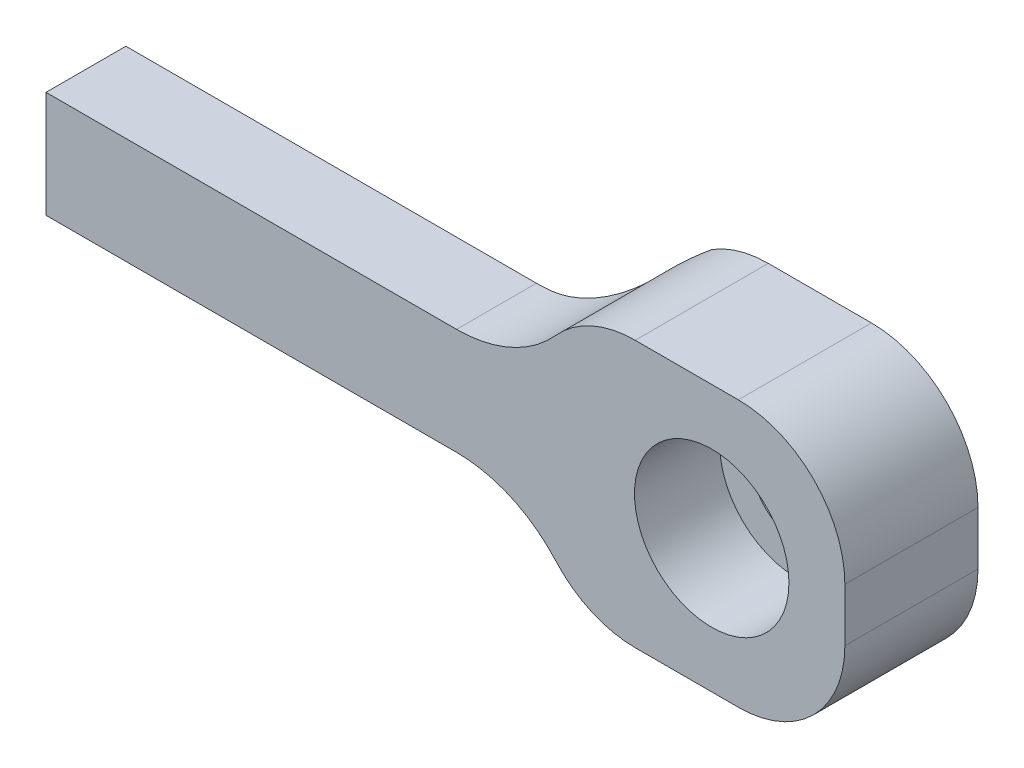
ISO-10303-21;
HEADER;
FILE_DESCRIPTION(('STEP AP214'),'2;1');
FILE_NAME('part.step','',(''),(''),'','','');
FILE_SCHEMA(('AUTOMOTIVE_DESIGN { 1 0 10303 214 1 1 1 1 }'));
ENDSEC;
DATA;
#1=APPLICATION_CONTEXT('core data for automotive mechanical design processes');
#2=APPLICATION_PROTOCOL_DEFINITION('international standard','automotive_design',2000,#1);
#3=PRODUCT_CONTEXT('',#1,'mechanical');
#4=PRODUCT('Part','Part','',(#3));
#5=PRODUCT_RELATED_PRODUCT_CATEGORY('part','',(#4));
#6=PRODUCT_DEFINITION_FORMATION('','',#4);
#7=PRODUCT_DEFINITION_CONTEXT('part definition',#1,'design');
#8=PRODUCT_DEFINITION('design','',#6,#7);
#9=PRODUCT_DEFINITION_SHAPE('','',#8);
#10=(LENGTH_UNIT() NAMED_UNIT(*) SI_UNIT(.MILLI.,.METRE.));
#11=(NAMED_UNIT(*) PLANE_ANGLE_UNIT() SI_UNIT($,.RADIAN.));
#12=(NAMED_UNIT(*) SI_UNIT($,.STERADIAN.) SOLID_ANGLE_UNIT());
#13=UNCERTAINTY_MEASURE_WITH_UNIT(LENGTH_MEASURE(1.E-05),#10,'distance_accuracy_value','');
#14=(GEOMETRIC_REPRESENTATION_CONTEXT(3) GLOBAL_UNCERTAINTY_ASSIGNED_CONTEXT((#13)) GLOBAL_UNIT_ASSIGNED_CONTEXT((#10,
#11,#12)) REPRESENTATION_CONTEXT('',''));
#15=CARTESIAN_POINT('',(0.,0.,0.));
#16=DIRECTION('',(0.,0.,1.));
#17=DIRECTION('',(1.,0.,0.));
#18=AXIS2_PLACEMENT_3D('',#15,#16,#17);
#19=CARTESIAN_POINT('',(0.,0.,0.));
#20=DIRECTION('',(0.,0.,1.));
#21=DIRECTION('',(1.,0.,0.));
#22=AXIS2_PLACEMENT_3D('',#19,#20,#21);
#23=CYLINDRICAL_SURFACE('',#22,2.159);
#24=CARTESIAN_POINT('',(0.,0.,0.));
#25=DIRECTION('',(0.,0.,1.));
#26=DIRECTION('',(1.,0.,0.));
#27=AXIS2_PLACEMENT_3D('',#24,#25,#26);
#28=CIRCLE('',#27,2.159);
#29=CARTESIAN_POINT('',(2.159,0.,0.));
#30=VERTEX_POINT('',#29);
#31=EDGE_CURVE('E184',#30,#30,#28,.T.);
#32=ORIENTED_EDGE('',*,*,#31,.F.);
#33=EDGE_LOOP('',(#32));
#34=FACE_BOUND('',#33,.T.);
#35=CARTESIAN_POINT('',(0.,0.,2.286));
#36=DIRECTION('',(0.,0.,1.));
#37=DIRECTION('',(1.,0.,0.));
#38=AXIS2_PLACEMENT_3D('',#35,#36,#37);
#39=CIRCLE('',#38,2.159);
#40=CARTESIAN_POINT('',(2.159,0.,2.286));
#41=VERTEX_POINT('',#40);
#42=EDGE_CURVE('E180',#41,#41,#39,.F.);
#43=ORIENTED_EDGE('',*,*,#42,.F.);
#44=EDGE_LOOP('',(#43));
#45=FACE_BOUND('',#44,.T.);
#46=ADVANCED_FACE('F37',(#34,#45),#23,.F.);
#47=CARTESIAN_POINT('',(6.35,-6.35,6.35));
#48=DIRECTION('',(-1.,0.,0.));
#49=DIRECTION('',(0.,-1.,0.));
#50=AXIS2_PLACEMENT_3D('',#47,#48,#49);
#51=PLANE('',#50);
#52=DIRECTION('',(0.,1.,0.));
#53=VECTOR('',#52,1.);
#54=CARTESIAN_POINT('',(6.35,-6.35,6.35));
#55=LINE('',#54,#53);
#56=CARTESIAN_POINT('',(6.35,-1.27,6.35));
#57=VERTEX_POINT('',#56);
#58=CARTESIAN_POINT('',(6.35,1.27,6.35));
#59=VERTEX_POINT('',#58);
#60=EDGE_CURVE('E188',#57,#59,#55,.T.);
#61=ORIENTED_EDGE('',*,*,#60,.F.);
#62=DIRECTION('',(0.,0.,-1.));
#63=VECTOR('',#62,1.);
#64=CARTESIAN_POINT('',(6.35,-1.27,6.35));
#65=LINE('',#64,#63);
#66=CARTESIAN_POINT('',(6.35,-1.27,0.));
#67=VERTEX_POINT('',#66);
#68=EDGE_CURVE('E379',#57,#67,#65,.T.);
#69=ORIENTED_EDGE('',*,*,#68,.T.);
#70=DIRECTION('',(0.,1.,0.));
#71=VECTOR('',#70,1.);
#72=CARTESIAN_POINT('',(6.35,-6.35,0.));
#73=LINE('',#72,#71);
#74=CARTESIAN_POINT('',(6.35,1.27,0.));
#75=VERTEX_POINT('',#74);
#76=EDGE_CURVE('E187',#67,#75,#73,.T.);
#77=ORIENTED_EDGE('',*,*,#76,.T.);
#78=DIRECTION('',(0.,0.,-1.));
#79=VECTOR('',#78,1.);
#80=CARTESIAN_POINT('',(6.35,1.27,6.35));
#81=LINE('',#80,#79);
#82=EDGE_CURVE('E377',#75,#59,#81,.F.);
#83=ORIENTED_EDGE('',*,*,#82,.T.);
#84=EDGE_LOOP('',(#61,#69,#77,#83));
#85=FACE_BOUND('',#84,.T.);
#86=ADVANCED_FACE('F252',(#85),#51,.F.);
#87=CARTESIAN_POINT('',(-31.75,6.35,6.35));
#88=DIRECTION('',(0.,-1.,0.));
#89=DIRECTION('',(0.,0.,-1.));
#90=AXIS2_PLACEMENT_3D('',#87,#88,#89);
#91=PLANE('',#90);
#92=DIRECTION('',(-1.,0.,0.));
#93=VECTOR('',#92,1.);
#94=CARTESIAN_POINT('',(-31.75,6.35,0.));
#95=LINE('',#94,#93);
#96=CARTESIAN_POINT('',(1.26999999999999,6.35,0.));
#97=VERTEX_POINT('',#96);
#98=CARTESIAN_POINT('',(-3.65045213831973,6.35,0.));
#99=VERTEX_POINT('',#98);
#100=EDGE_CURVE('E202',#97,#99,#95,.T.);
#101=ORIENTED_EDGE('',*,*,#100,.T.);
#102=DIRECTION('',(0.,0.,-1.));
#103=VECTOR('',#102,1.);
#104=CARTESIAN_POINT('',(-3.65045213831972,6.35,6.35));
#105=LINE('',#104,#103);
#106=CARTESIAN_POINT('',(-3.65045213831973,6.35,6.35));
#107=VERTEX_POINT('',#106);
#108=EDGE_CURVE('E354',#99,#107,#105,.F.);
#109=ORIENTED_EDGE('',*,*,#108,.T.);
#110=DIRECTION('',(-1.,0.,0.));
#111=VECTOR('',#110,1.);
#112=CARTESIAN_POINT('',(-31.75,6.35,6.35));
#113=LINE('',#112,#111);
#114=CARTESIAN_POINT('',(1.26999999999999,6.35,6.35));
#115=VERTEX_POINT('',#114);
#116=EDGE_CURVE('E191',#115,#107,#113,.T.);
#117=ORIENTED_EDGE('',*,*,#116,.F.);
#118=DIRECTION('',(0.,0.,-1.));
#119=VECTOR('',#118,1.);
#120=CARTESIAN_POINT('',(1.27,6.35,6.35));
#121=LINE('',#120,#119);
#122=EDGE_CURVE('E355',#115,#97,#121,.T.);
#123=ORIENTED_EDGE('',*,*,#122,.T.);
#124=EDGE_LOOP('',(#101,#109,#117,#123));
#125=FACE_BOUND('',#124,.T.);
#126=ADVANCED_FACE('F266',(#125),#91,.F.);
#127=CARTESIAN_POINT('',(-31.75,-6.35,6.35));
#128=DIRECTION('',(1.,0.,0.));
#129=DIRECTION('',(0.,0.,-1.));
#130=AXIS2_PLACEMENT_3D('',#127,#128,#129);
#131=PLANE('',#130);
#132=DIRECTION('',(0.,0.,1.));
#133=VECTOR('',#132,1.);
#134=CARTESIAN_POINT('',(-31.75,2.54,0.));
#135=LINE('',#134,#133);
#136=CARTESIAN_POINT('',(-31.75,2.54,2.54));
#137=VERTEX_POINT('',#136);
#138=CARTESIAN_POINT('',(-31.75,2.54,6.35));
#139=VERTEX_POINT('',#138);
#140=EDGE_CURVE('E165',#137,#139,#135,.T.);
#141=ORIENTED_EDGE('',*,*,#140,.F.);
#142=DIRECTION('',(0.,1.,0.));
#143=VECTOR('',#142,1.);
#144=CARTESIAN_POINT('',(-31.75,-6.35,2.54));
#145=LINE('',#144,#143);
#146=CARTESIAN_POINT('',(-31.75,-2.54,2.54));
#147=VERTEX_POINT('',#146);
#148=EDGE_CURVE('E149',#147,#137,#145,.T.);
#149=ORIENTED_EDGE('',*,*,#148,.F.);
#150=DIRECTION('',(0.,0.,1.));
#151=VECTOR('',#150,1.);
#152=CARTESIAN_POINT('',(-31.75,-2.54,0.));
#153=LINE('',#152,#151);
#154=CARTESIAN_POINT('',(-31.75,-2.54,6.35));
#155=VERTEX_POINT('',#154);
#156=EDGE_CURVE('E157',#147,#155,#153,.T.);
#157=ORIENTED_EDGE('',*,*,#156,.T.);
#158=DIRECTION('',(0.,-1.,0.));
#159=VECTOR('',#158,1.);
#160=CARTESIAN_POINT('',(-31.75,-6.35,6.35));
#161=LINE('',#160,#159);
#162=EDGE_CURVE('E195',#139,#155,#161,.T.);
#163=ORIENTED_EDGE('',*,*,#162,.F.);
#164=EDGE_LOOP('',(#141,#149,#157,#163));
#165=FACE_BOUND('',#164,.T.);
#166=ADVANCED_FACE('F162',(#165),#131,.F.);
#167=CARTESIAN_POINT('',(-31.75,-6.35,6.35));
#168=DIRECTION('',(0.,1.,0.));
#169=DIRECTION('',(0.,0.,1.));
#170=AXIS2_PLACEMENT_3D('',#167,#168,#169);
#171=PLANE('',#170);
#172=DIRECTION('',(1.,0.,0.));
#173=VECTOR('',#172,1.);
#174=CARTESIAN_POINT('',(-31.75,-6.35,0.));
#175=LINE('',#174,#173);
#176=CARTESIAN_POINT('',(-3.65045213831972,-6.35,0.));
#177=VERTEX_POINT('',#176);
#178=CARTESIAN_POINT('',(1.26999999999999,-6.35,0.));
#179=VERTEX_POINT('',#178);
#180=EDGE_CURVE('E192',#177,#179,#175,.T.);
#181=ORIENTED_EDGE('',*,*,#180,.T.);
#182=DIRECTION('',(0.,0.,-1.));
#183=VECTOR('',#182,1.);
#184=CARTESIAN_POINT('',(1.27,-6.35,6.35));
#185=LINE('',#184,#183);
#186=CARTESIAN_POINT('',(1.26999999999999,-6.35,6.35));
#187=VERTEX_POINT('',#186);
#188=EDGE_CURVE('E45',#179,#187,#185,.F.);
#189=ORIENTED_EDGE('',*,*,#188,.T.);
#190=DIRECTION('',(1.,0.,0.));
#191=VECTOR('',#190,1.);
#192=CARTESIAN_POINT('',(-31.75,-6.35,6.35));
#193=LINE('',#192,#191);
#194=CARTESIAN_POINT('',(-3.65045213831972,-6.35,6.35));
#195=VERTEX_POINT('',#194);
#196=EDGE_CURVE('E197',#195,#187,#193,.T.);
#197=ORIENTED_EDGE('',*,*,#196,.F.);
#198=DIRECTION('',(0.,0.,1.));
#199=VECTOR('',#198,1.);
#200=CARTESIAN_POINT('',(-3.65045213831972,-6.35,6.35));
#201=LINE('',#200,#199);
#202=EDGE_CURVE('E385',#195,#177,#201,.F.);
#203=ORIENTED_EDGE('',*,*,#202,.T.);
#204=EDGE_LOOP('',(#181,#189,#197,#203));
#205=FACE_BOUND('',#204,.T.);
#206=ADVANCED_FACE('F257',(#205),#171,.F.);
#207=CARTESIAN_POINT('',(0.,0.,6.35));
#208=DIRECTION('',(0.,0.,-1.));
#209=DIRECTION('',(-1.,0.,0.));
#210=AXIS2_PLACEMENT_3D('',#207,#208,#209);
#211=PLANE('',#210);
#212=CARTESIAN_POINT('',(0.,0.,6.35));
#213=DIRECTION('',(0.,0.,1.));
#214=DIRECTION('',(1.,0.,0.));
#215=AXIS2_PLACEMENT_3D('',#212,#213,#214);
#216=CIRCLE('',#215,3.683);
#217=CARTESIAN_POINT('',(3.683,0.,6.35));
#218=VERTEX_POINT('',#217);
#219=EDGE_CURVE('E181',#218,#218,#216,.T.);
#220=ORIENTED_EDGE('',*,*,#219,.F.);
#221=EDGE_LOOP('',(#220));
#222=FACE_BOUND('',#221,.T.);
#223=ORIENTED_EDGE('',*,*,#116,.T.);
#224=CARTESIAN_POINT('',(-3.65045213831972,1.27,6.35));
#225=DIRECTION('',(0.,0.,-1.));
#226=DIRECTION('',(-1.,0.,0.));
#227=AXIS2_PLACEMENT_3D('',#224,#225,#226);
#228=CIRCLE('',#227,5.08);
#229=CARTESIAN_POINT('',(-7.43686058021936,4.65666666666667,6.35));
#230=VERTEX_POINT('',#229);
#231=EDGE_CURVE('E344',#107,#230,#228,.F.);
#232=ORIENTED_EDGE('',*,*,#231,.T.);
#233=CARTESIAN_POINT('',(-12.1698711325939,8.89,6.35));
#234=DIRECTION('',(0.,0.,-1.));
#235=DIRECTION('',(-1.,0.,0.));
#236=AXIS2_PLACEMENT_3D('',#233,#234,#235);
#237=CIRCLE('',#236,6.35);
#238=CARTESIAN_POINT('',(-12.1698711325939,2.54,6.35));
#239=VERTEX_POINT('',#238);
#240=EDGE_CURVE('E333',#230,#239,#237,.T.);
#241=ORIENTED_EDGE('',*,*,#240,.T.);
#242=DIRECTION('',(1.,0.,0.));
#243=VECTOR('',#242,1.);
#244=CARTESIAN_POINT('',(-31.75,2.54,6.35));
#245=LINE('',#244,#243);
#246=EDGE_CURVE('E172',#139,#239,#245,.T.);
#247=ORIENTED_EDGE('',*,*,#246,.F.);
#248=ORIENTED_EDGE('',*,*,#162,.T.);
#249=DIRECTION('',(-1.,0.,0.));
#250=VECTOR('',#249,1.);
#251=CARTESIAN_POINT('',(-31.75,-2.54,6.35));
#252=LINE('',#251,#250);
#253=CARTESIAN_POINT('',(-12.1698711325939,-2.54,6.35));
#254=VERTEX_POINT('',#253);
#255=EDGE_CURVE('E170',#254,#155,#252,.T.);
#256=ORIENTED_EDGE('',*,*,#255,.F.);
#257=CARTESIAN_POINT('',(-12.1698711325939,-8.89,6.35));
#258=DIRECTION('',(0.,0.,-1.));
#259=DIRECTION('',(-1.,0.,0.));
#260=AXIS2_PLACEMENT_3D('',#257,#258,#259);
#261=CIRCLE('',#260,6.35);
#262=CARTESIAN_POINT('',(-7.43686058021936,-4.65666666666667,6.35));
#263=VERTEX_POINT('',#262);
#264=EDGE_CURVE('E214',#254,#263,#261,.T.);
#265=ORIENTED_EDGE('',*,*,#264,.T.);
#266=CARTESIAN_POINT('',(-3.65045213831972,-1.27,6.35));
#267=DIRECTION('',(0.,0.,-1.));
#268=DIRECTION('',(-1.,0.,0.));
#269=AXIS2_PLACEMENT_3D('',#266,#267,#268);
#270=CIRCLE('',#269,5.08);
#271=EDGE_CURVE('E348',#263,#195,#270,.F.);
#272=ORIENTED_EDGE('',*,*,#271,.T.);
#273=ORIENTED_EDGE('',*,*,#196,.T.);
#274=CARTESIAN_POINT('',(1.27,-1.27,6.35));
#275=DIRECTION('',(0.,0.,-1.));
#276=DIRECTION('',(-1.,0.,0.));
#277=AXIS2_PLACEMENT_3D('',#274,#275,#276);
#278=CIRCLE('',#277,5.08);
#279=EDGE_CURVE('E347',#187,#57,#278,.F.);
#280=ORIENTED_EDGE('',*,*,#279,.T.);
#281=ORIENTED_EDGE('',*,*,#60,.T.);
#282=CARTESIAN_POINT('',(1.27,1.27,6.35));
#283=DIRECTION('',(0.,0.,-1.));
#284=DIRECTION('',(-1.,0.,0.));
#285=AXIS2_PLACEMENT_3D('',#282,#283,#284);
#286=CIRCLE('',#285,5.08);
#287=EDGE_CURVE('E352',#59,#115,#286,.F.);
#288=ORIENTED_EDGE('',*,*,#287,.T.);
#289=EDGE_LOOP('',(#223,#232,#241,#247,#248,#256,#265,#272,#273,#280,#281,#288));
#290=FACE_BOUND('',#289,.T.);
#291=ADVANCED_FACE('F254',(#222,#290),#211,.F.);
#292=CARTESIAN_POINT('',(0.,0.,0.));
#293=DIRECTION('',(0.,0.,-1.));
#294=DIRECTION('',(-1.,0.,0.));
#295=AXIS2_PLACEMENT_3D('',#292,#293,#294);
#296=PLANE('',#295);
#297=DIRECTION('',(0.,1.,0.));
#298=VECTOR('',#297,1.);
#299=CARTESIAN_POINT('',(-6.35,6.35,0.));
#300=LINE('',#299,#298);
#301=CARTESIAN_POINT('',(-6.35,-5.57335233771271,0.));
#302=VERTEX_POINT('',#301);
#303=CARTESIAN_POINT('',(-6.35,5.57335233771271,0.));
#304=VERTEX_POINT('',#303);
#305=EDGE_CURVE('E368',#302,#304,#300,.T.);
#306=ORIENTED_EDGE('',*,*,#305,.T.);
#307=CARTESIAN_POINT('',(-3.65045213831972,1.27,0.));
#308=DIRECTION('',(0.,0.,-1.));
#309=DIRECTION('',(-1.,0.,0.));
#310=AXIS2_PLACEMENT_3D('',#307,#308,#309);
#311=CIRCLE('',#310,5.08);
#312=EDGE_CURVE('E373',#304,#99,#311,.T.);
#313=ORIENTED_EDGE('',*,*,#312,.T.);
#314=ORIENTED_EDGE('',*,*,#100,.F.);
#315=CARTESIAN_POINT('',(1.27,1.27,0.));
#316=DIRECTION('',(0.,0.,-1.));
#317=DIRECTION('',(-1.,0.,0.));
#318=AXIS2_PLACEMENT_3D('',#315,#316,#317);
#319=CIRCLE('',#318,5.08);
#320=EDGE_CURVE('E52',#97,#75,#319,.T.);
#321=ORIENTED_EDGE('',*,*,#320,.T.);
#322=ORIENTED_EDGE('',*,*,#76,.F.);
#323=CARTESIAN_POINT('',(1.27,-1.27,0.));
#324=DIRECTION('',(0.,0.,-1.));
#325=DIRECTION('',(-1.,0.,0.));
#326=AXIS2_PLACEMENT_3D('',#323,#324,#325);
#327=CIRCLE('',#326,5.08);
#328=EDGE_CURVE('E60',#67,#179,#327,.T.);
#329=ORIENTED_EDGE('',*,*,#328,.T.);
#330=ORIENTED_EDGE('',*,*,#180,.F.);
#331=CARTESIAN_POINT('',(-3.65045213831972,-1.27,0.));
#332=DIRECTION('',(0.,0.,-1.));
#333=DIRECTION('',(-1.,0.,0.));
#334=AXIS2_PLACEMENT_3D('',#331,#332,#333);
#335=CIRCLE('',#334,5.08);
#336=EDGE_CURVE('E376',#177,#302,#335,.T.);
#337=ORIENTED_EDGE('',*,*,#336,.T.);
#338=EDGE_LOOP('',(#306,#313,#314,#321,#322,#329,#330,#337));
#339=FACE_BOUND('',#338,.T.);
#340=ORIENTED_EDGE('',*,*,#31,.T.);
#341=EDGE_LOOP('',(#340));
#342=FACE_BOUND('',#341,.T.);
#343=ADVANCED_FACE('F245',(#339,#342),#296,.T.);
#344=CARTESIAN_POINT('',(0.,0.,2.286));
#345=DIRECTION('',(0.,0.,1.));
#346=DIRECTION('',(1.,0.,0.));
#347=AXIS2_PLACEMENT_3D('',#344,#345,#346);
#348=PLANE('',#347);
#349=CARTESIAN_POINT('',(0.,0.,2.286));
#350=DIRECTION('',(0.,0.,1.));
#351=DIRECTION('',(1.,0.,0.));
#352=AXIS2_PLACEMENT_3D('',#349,#350,#351);
#353=CIRCLE('',#352,3.683);
#354=CARTESIAN_POINT('',(3.683,0.,2.286));
#355=VERTEX_POINT('',#354);
#356=EDGE_CURVE('E177',#355,#355,#353,.T.);
#357=ORIENTED_EDGE('',*,*,#356,.T.);
#358=EDGE_LOOP('',(#357));
#359=FACE_BOUND('',#358,.T.);
#360=ORIENTED_EDGE('',*,*,#42,.T.);
#361=EDGE_LOOP('',(#360));
#362=FACE_BOUND('',#361,.T.);
#363=ADVANCED_FACE('F242',(#359,#362),#348,.T.);
#364=CARTESIAN_POINT('',(0.,0.,2.286));
#365=DIRECTION('',(0.,0.,1.));
#366=DIRECTION('',(1.,0.,0.));
#367=AXIS2_PLACEMENT_3D('',#364,#365,#366);
#368=CYLINDRICAL_SURFACE('',#367,3.683);
#369=ORIENTED_EDGE('',*,*,#356,.F.);
#370=EDGE_LOOP('',(#369));
#371=FACE_BOUND('',#370,.T.);
#372=ORIENTED_EDGE('',*,*,#219,.T.);
#373=EDGE_LOOP('',(#372));
#374=FACE_BOUND('',#373,.T.);
#375=ADVANCED_FACE('F241',(#371,#374),#368,.F.);
#376=CARTESIAN_POINT('',(-31.75,-2.54,0.));
#377=DIRECTION('',(0.,1.,0.));
#378=DIRECTION('',(0.,0.,1.));
#379=AXIS2_PLACEMENT_3D('',#376,#377,#378);
#380=PLANE('',#379);
#381=DIRECTION('',(1.,0.,0.));
#382=VECTOR('',#381,1.);
#383=CARTESIAN_POINT('',(-31.75,-2.54,2.54));
#384=LINE('',#383,#382);
#385=CARTESIAN_POINT('',(-12.1698711325939,-2.54,2.54));
#386=VERTEX_POINT('',#385);
#387=EDGE_CURVE('E145',#147,#386,#384,.T.);
#388=ORIENTED_EDGE('',*,*,#387,.T.);
#389=DIRECTION('',(0.,0.,1.));
#390=VECTOR('',#389,1.);
#391=CARTESIAN_POINT('',(-12.1698711325939,-2.54,0.));
#392=LINE('',#391,#390);
#393=EDGE_CURVE('E200',#386,#254,#392,.T.);
#394=ORIENTED_EDGE('',*,*,#393,.T.);
#395=ORIENTED_EDGE('',*,*,#255,.T.);
#396=ORIENTED_EDGE('',*,*,#156,.F.);
#397=EDGE_LOOP('',(#388,#394,#395,#396));
#398=FACE_BOUND('',#397,.T.);
#399=ADVANCED_FACE('F168',(#398),#380,.F.);
#400=CARTESIAN_POINT('',(-31.75,2.54,0.));
#401=DIRECTION('',(0.,-1.,0.));
#402=DIRECTION('',(0.,0.,-1.));
#403=AXIS2_PLACEMENT_3D('',#400,#401,#402);
#404=PLANE('',#403);
#405=ORIENTED_EDGE('',*,*,#246,.T.);
#406=DIRECTION('',(0.,0.,-1.));
#407=VECTOR('',#406,1.);
#408=CARTESIAN_POINT('',(-12.1698711325939,2.54,0.));
#409=LINE('',#408,#407);
#410=CARTESIAN_POINT('',(-12.1698711325939,2.54,2.54));
#411=VERTEX_POINT('',#410);
#412=EDGE_CURVE('E212',#239,#411,#409,.T.);
#413=ORIENTED_EDGE('',*,*,#412,.T.);
#414=DIRECTION('',(1.,0.,0.));
#415=VECTOR('',#414,1.);
#416=CARTESIAN_POINT('',(-31.75,2.54,2.54));
#417=LINE('',#416,#415);
#418=EDGE_CURVE('E166',#137,#411,#417,.T.);
#419=ORIENTED_EDGE('',*,*,#418,.F.);
#420=ORIENTED_EDGE('',*,*,#140,.T.);
#421=EDGE_LOOP('',(#405,#413,#419,#420));
#422=FACE_BOUND('',#421,.T.);
#423=ADVANCED_FACE('F234',(#422),#404,.F.);
#424=CARTESIAN_POINT('',(-31.75,-6.35,2.54));
#425=DIRECTION('',(0.,0.,1.));
#426=DIRECTION('',(1.,0.,0.));
#427=AXIS2_PLACEMENT_3D('',#424,#425,#426);
#428=PLANE('',#427);
#429=ORIENTED_EDGE('',*,*,#418,.T.);
#430=CARTESIAN_POINT('',(-12.1698711325939,8.89,2.54));
#431=DIRECTION('',(0.,0.,1.));
#432=DIRECTION('',(1.,0.,0.));
#433=AXIS2_PLACEMENT_3D('',#430,#431,#432);
#434=CIRCLE('',#433,6.35);
#435=CARTESIAN_POINT('',(-11.43,2.58325038493248,2.54));
#436=VERTEX_POINT('',#435);
#437=EDGE_CURVE('E341',#411,#436,#434,.T.);
#438=ORIENTED_EDGE('',*,*,#437,.T.);
#439=CARTESIAN_POINT('',(-11.43,2.58325038493248,2.54));
#440=CARTESIAN_POINT('',(-11.43,2.54,2.54));
#441=B_SPLINE_CURVE_WITH_KNOTS('',1,(#439,#440),.UNSPECIFIED.,.F.,.F.,(2,2),(0.,1.),.UNSPECIFIED.);
#442=CARTESIAN_POINT('',(-11.43,2.54,2.54));
#443=VERTEX_POINT('',#442);
#444=EDGE_CURVE('E218',#436,#443,#441,.T.);
#445=ORIENTED_EDGE('',*,*,#444,.T.);
#446=DIRECTION('',(0.,1.,0.));
#447=VECTOR('',#446,1.);
#448=CARTESIAN_POINT('',(-11.43,-6.34999999999999,2.54));
#449=LINE('',#448,#447);
#450=CARTESIAN_POINT('',(-11.43,-2.54,2.54));
#451=VERTEX_POINT('',#450);
#452=EDGE_CURVE('E210',#443,#451,#449,.F.);
#453=ORIENTED_EDGE('',*,*,#452,.T.);
#454=CARTESIAN_POINT('',(-11.43,-2.54,2.54));
#455=CARTESIAN_POINT('',(-11.43,-2.58325038493249,2.54));
#456=B_SPLINE_CURVE_WITH_KNOTS('',1,(#454,#455),.UNSPECIFIED.,.F.,.F.,(2,2),(0.,1.),.UNSPECIFIED.);
#457=CARTESIAN_POINT('',(-11.43,-2.58325038493248,2.54));
#458=VERTEX_POINT('',#457);
#459=EDGE_CURVE('E222',#451,#458,#456,.T.);
#460=ORIENTED_EDGE('',*,*,#459,.T.);
#461=CARTESIAN_POINT('',(-12.1698711325939,-8.89,2.54));
#462=DIRECTION('',(0.,0.,1.));
#463=DIRECTION('',(1.,0.,0.));
#464=AXIS2_PLACEMENT_3D('',#461,#462,#463);
#465=CIRCLE('',#464,6.35);
#466=EDGE_CURVE('E152',#458,#386,#465,.T.);
#467=ORIENTED_EDGE('',*,*,#466,.T.);
#468=ORIENTED_EDGE('',*,*,#387,.F.);
#469=ORIENTED_EDGE('',*,*,#148,.T.);
#470=EDGE_LOOP('',(#429,#438,#445,#453,#460,#467,#468,#469));
#471=FACE_BOUND('',#470,.T.);
#472=ADVANCED_FACE('F148',(#471),#428,.F.);
#473=CARTESIAN_POINT('',(-12.1698711325939,8.89,0.));
#474=DIRECTION('',(0.,0.,-1.));
#475=DIRECTION('',(-1.,0.,0.));
#476=AXIS2_PLACEMENT_3D('',#473,#474,#475);
#477=CYLINDRICAL_SURFACE('',#476,6.35);
#478=ORIENTED_EDGE('',*,*,#240,.F.);
#479=DIRECTION('',(0.,0.,-1.));
#480=VECTOR('',#479,1.);
#481=CARTESIAN_POINT('',(-7.43686058021936,4.65666666666667,0.));
#482=LINE('',#481,#480);
#483=CARTESIAN_POINT('',(-7.43686058021936,4.65666666666667,1.12734114419836));
#484=VERTEX_POINT('',#483);
#485=EDGE_CURVE('E307',#230,#484,#482,.T.);
#486=ORIENTED_EDGE('',*,*,#485,.T.);
#487=CARTESIAN_POINT('',(-6.35,6.35,0.));
#488=CARTESIAN_POINT('',(-6.38962755887672,6.25922081143416,0.0528449953052917));
#489=CARTESIAN_POINT('',(-6.43117769749384,6.16979164164938,0.106518847414344));
#490=CARTESIAN_POINT('',(-6.51809609061888,5.99351646037677,0.214986424220671));
#491=CARTESIAN_POINT('',(-6.56346398888857,5.90667020889599,0.26978004407106));
#492=CARTESIAN_POINT('',(-6.7053225140108,5.64970207480904,0.435115608272117));
#493=CARTESIAN_POINT('',(-6.80752002759935,5.48326021942287,0.546547106226217));
#494=CARTESIAN_POINT('',(-7.02815460755617,5.15849304413829,0.769422596267791));
#495=CARTESIAN_POINT('',(-7.14673623388483,5.00025946451225,0.880856722700129));
#496=CARTESIAN_POINT('',(-7.39959273729251,4.69400890041357,1.09981377642161));
#497=CARTESIAN_POINT('',(-7.53386101169505,4.54598765888955,1.20733832448351));
#498=CARTESIAN_POINT('',(-7.78616043817361,4.29327902201883,1.3922657212725));
#499=CARTESIAN_POINT('',(-7.90100048104682,4.18636000204907,1.47098298084308));
#500=CARTESIAN_POINT('',(-8.14029042552072,3.97981115347839,1.62326950366137));
#501=CARTESIAN_POINT('',(-8.26474012239641,3.88018116967914,1.69683887651655));
#502=CARTESIAN_POINT('',(-8.52277626802043,3.68933967417985,1.83730577976911));
#503=CARTESIAN_POINT('',(-8.65633269432654,3.59810262751423,1.90422360074701));
#504=CARTESIAN_POINT('',(-8.93267752207773,3.42468505634627,2.03028490063646));
#505=CARTESIAN_POINT('',(-9.07546354463171,3.34250221281195,2.08943037101379));
#506=CARTESIAN_POINT('',(-9.3394967898524,3.20414907971449,2.18731963711253));
#507=CARTESIAN_POINT('',(-9.45913693179212,3.14610452654186,2.22775788944072));
#508=CARTESIAN_POINT('',(-9.70351277895214,3.03701172452349,2.30212280306171));
#509=CARTESIAN_POINT('',(-9.82824737554879,2.98596196393365,2.33605087199951));
#510=CARTESIAN_POINT('',(-10.0820801551536,2.89150531590295,2.39665864314528));
#511=CARTESIAN_POINT('',(-10.2111716328237,2.84808726997517,2.4233489593628));
#512=CARTESIAN_POINT('',(-10.4731089224143,2.76936366770211,2.46889484036919));
#513=CARTESIAN_POINT('',(-10.6059529740163,2.73405437627524,2.48775401561271));
#514=CARTESIAN_POINT('',(-10.8535684085427,2.67683919961794,2.51480941403776));
#515=CARTESIAN_POINT('',(-10.9679252405845,2.65370156848661,2.52421030406253));
#516=CARTESIAN_POINT('',(-11.1980538639296,2.61371461718818,2.53681232833328));
#517=CARTESIAN_POINT('',(-11.3138254789924,2.59686452186126,2.54001422702686));
#518=CARTESIAN_POINT('',(-11.43,2.58325038493249,2.54));
#519=B_SPLINE_CURVE_WITH_KNOTS('',3,(#487,#488,#489,#490,#491,#492,#493,#494,#495,#496,#497,
#498,#499,#500,#501,#502,#503,#504,#505,#506,#507,#508,#509,#510,#511,#512,#513,#514,#515,#516,
#517,#518),.UNSPECIFIED.,.F.,.F.,(4,2,2,2,2,2,2,2,2,2,2,2,2,2,2,4),(0.,0.336732587926477,
0.673433789831715,1.34724313879832,2.02743047397917,2.70733253561782,3.23353372246952,
3.75972370217081,4.28425582162233,4.80865328000836,5.2252388724057,5.64173428807246,
6.0576155778962,6.47330491712828,6.8241290403257,7.17490989781563),.UNSPECIFIED.);
#520=EDGE_CURVE('E293',#436,#484,#519,.F.);
#521=ORIENTED_EDGE('',*,*,#520,.F.);
#522=ORIENTED_EDGE('',*,*,#437,.F.);
#523=ORIENTED_EDGE('',*,*,#412,.F.);
#524=EDGE_LOOP('',(#478,#486,#521,#522,#523));
#525=FACE_BOUND('',#524,.T.);
#526=ADVANCED_FACE('F233',(#525),#477,.F.);
#527=CARTESIAN_POINT('',(-11.43,6.35,-3.81));
#528=DIRECTION('',(0.,1.,0.));
#529=DIRECTION('',(-1.,0.,0.));
#530=AXIS2_PLACEMENT_3D('',#527,#528,#529);
#531=CYLINDRICAL_SURFACE('',#530,6.35);
#532=ORIENTED_EDGE('',*,*,#520,.T.);
#533=CARTESIAN_POINT('',(-7.43686058021936,4.65666666666667,1.12734114419836));
#534=CARTESIAN_POINT('',(-7.3634144615403,4.73882158959006,1.06797251384768));
#535=CARTESIAN_POINT('',(-7.28864994532518,4.8169949317357,1.00476601544157));
#536=CARTESIAN_POINT('',(-7.1378864345644,4.9653090617488,0.870848307704927));
#537=CARTESIAN_POINT('',(-7.06188748080358,5.03545011438285,0.80013734589048));
#538=CARTESIAN_POINT('',(-6.91132088400916,5.16653135990631,0.652620604955543));
#539=CARTESIAN_POINT('',(-6.8367505433165,5.2276057066899,0.575936405309179));
#540=CARTESIAN_POINT('',(-6.68905588822992,5.34210121143783,0.415847988747894));
#541=CARTESIAN_POINT('',(-6.61593083830135,5.39552635342848,0.332447305687597));
#542=CARTESIAN_POINT('',(-6.51120994697796,5.46810302392837,0.206299645596277));
#543=CARTESIAN_POINT('',(-6.4785897125648,5.49013463161345,0.166022341972323));
#544=CARTESIAN_POINT('',(-6.41385650259337,5.53280464441326,0.0840393849771175));
#545=CARTESIAN_POINT('',(-6.38174600278489,5.55343727829399,0.0423287717780392));
#546=CARTESIAN_POINT('',(-6.35,5.57335233771271,0.));
#547=B_SPLINE_CURVE_WITH_KNOTS('',3,(#533,#534,#535,#536,#537,#538,#539,#540,#541,#542,#543,
#544,#545,#546),.UNSPECIFIED.,.F.,.F.,(4,2,2,2,2,2,4),(0.,0.375368625681894,0.750724874606897,
1.11980932569512,1.48870083732778,1.65762450507042,1.82720726040723),.UNSPECIFIED.);
#548=EDGE_CURVE('E306',#484,#304,#547,.T.);
#549=ORIENTED_EDGE('',*,*,#548,.T.);
#550=ORIENTED_EDGE('',*,*,#305,.F.);
#551=CARTESIAN_POINT('',(-6.35,-5.57335233771271,0.));
#552=CARTESIAN_POINT('',(-6.42023480411029,-5.529302828888,0.0936994028338508));
#553=CARTESIAN_POINT('',(-6.49232300912781,-5.48167575630942,0.184367523771791));
#554=CARTESIAN_POINT('',(-6.63908863612413,-5.37882806187329,0.359244937139452));
#555=CARTESIAN_POINT('',(-6.71376866578227,-5.32359961616033,0.443447433764354));
#556=CARTESIAN_POINT('',(-6.86311323983977,-5.20625066971248,0.603369810741196));
#557=CARTESIAN_POINT('',(-6.93775455845976,-5.14426980851087,0.679213669607676));
#558=CARTESIAN_POINT('',(-7.08698076924827,-5.01253372307316,0.823729836126878));
#559=CARTESIAN_POINT('',(-7.16156565362807,-4.94278535040972,0.892408362203812));
#560=CARTESIAN_POINT('',(-7.26933096152282,-4.83544595433026,0.987225623042096));
#561=CARTESIAN_POINT('',(-7.30305135123304,-4.80090518149417,1.01625300868492));
#562=CARTESIAN_POINT('',(-7.37022400052603,-4.7300707713215,1.0728942019416));
#563=CARTESIAN_POINT('',(-7.40367459131158,-4.69377052079345,1.10050171797987));
#564=CARTESIAN_POINT('',(-7.43686058021936,-4.65666666666667,1.12734114419836));
#565=B_SPLINE_CURVE_WITH_KNOTS('',3,(#551,#552,#553,#554,#555,#556,#557,#558,#559,#560,#561,
#562,#563,#564),.UNSPECIFIED.,.F.,.F.,(4,2,2,2,2,2,4),(0.,0.3752821550021,0.750953505714213,
1.11996071550674,1.48864497139017,1.65758747462074,1.82722345579674),.UNSPECIFIED.);
#566=CARTESIAN_POINT('',(-7.43686058021936,-4.65666666666667,1.12734114419836));
#567=VERTEX_POINT('',#566);
#568=EDGE_CURVE('E300',#302,#567,#565,.T.);
#569=ORIENTED_EDGE('',*,*,#568,.T.);
#570=CARTESIAN_POINT('',(-7.53373110259537,-13.2292056441525,1.20413887712763));
#571=CARTESIAN_POINT('',(-7.46723013079144,-13.1581490085541,1.15246370999595));
#572=CARTESIAN_POINT('',(-7.40261051130312,-13.0858387775392,1.1001285891405));
#573=CARTESIAN_POINT('',(-7.27709967083795,-12.9387825087164,0.994440804220754));
#574=CARTESIAN_POINT('',(-7.21620807951231,-12.8640367139957,0.941088241923715));
#575=CARTESIAN_POINT('',(-7.03895525692361,-12.6361036769198,0.779851801479423));
#576=CARTESIAN_POINT('',(-6.92812772946306,-12.4793405431514,0.670877109150886));
#577=CARTESIAN_POINT('',(-6.71968521608009,-12.1543194328139,0.451297316163092));
#578=CARTESIAN_POINT('',(-6.62227362295213,-11.9859327017723,0.340690465093291));
#579=CARTESIAN_POINT('',(-6.4425728060559,-11.6392981662283,0.122932890953591));
#580=CARTESIAN_POINT('',(-6.3602729390462,-11.4610574179541,0.0157797795960092));
#581=CARTESIAN_POINT('',(-6.207402136611,-11.0842903821257,-0.195478454757876));
#582=CARTESIAN_POINT('',(-6.13763061793372,-10.8851945535813,-0.299158309857311));
#583=CARTESIAN_POINT('',(-6.01678960208494,-10.4736219644771,-0.488524229290101));
#584=CARTESIAN_POINT('',(-5.96565799908277,-10.2611924557454,-0.574269634177046));
#585=CARTESIAN_POINT('',(-5.89344786706797,-9.8695699724364,-0.699819103982713));
#586=CARTESIAN_POINT('',(-5.86826327234424,-9.69311047172713,-0.745546181729713));
#587=CARTESIAN_POINT('',(-5.83287047691896,-9.33411674224532,-0.810651088500352));
#588=CARTESIAN_POINT('',(-5.82262118030514,-9.15160060155143,-0.83010121029689));
#589=CARTESIAN_POINT('',(-5.81808426590765,-8.78481005979607,-0.838644302307692));
#590=CARTESIAN_POINT('',(-5.82386718584385,-8.60053145488712,-0.827603119278018));
#591=CARTESIAN_POINT('',(-5.85090865213039,-8.23679882760607,-0.777352415077626));
#592=CARTESIAN_POINT('',(-5.87220626059408,-8.05735817077599,-0.738071797339381));
#593=CARTESIAN_POINT('',(-5.92104877253506,-7.75342533906402,-0.651566659544348));
#594=CARTESIAN_POINT('',(-5.94545267460783,-7.62694982258273,-0.609189097061141));
#595=CARTESIAN_POINT('',(-6.00102528689574,-7.37870342699151,-0.515810000485828));
#596=CARTESIAN_POINT('',(-6.03219804102292,-7.25693541173409,-0.464803315142193));
#597=CARTESIAN_POINT('',(-6.10089822680875,-7.01766964208726,-0.35640735545578));
#598=CARTESIAN_POINT('',(-6.13844602625007,-6.90018708871218,-0.298997832843094));
#599=CARTESIAN_POINT('',(-6.21948931899293,-6.66955128846658,-0.179809128860947));
#600=CARTESIAN_POINT('',(-6.26298687424753,-6.55639955996623,-0.118028436213621));
#601=CARTESIAN_POINT('',(-6.38774604152209,-6.2573114766668,0.0520839210763033));
#602=CARTESIAN_POINT('',(-6.47433573653512,-6.07509985857068,0.163087328570947));
#603=CARTESIAN_POINT('',(-6.66346816087111,-5.72104045192483,0.388136755132336));
#604=CARTESIAN_POINT('',(-6.76602084154524,-5.5491992216571,0.502184635133208));
#605=CARTESIAN_POINT('',(-6.98696916170233,-5.21576859012212,0.729502713891983));
#606=CARTESIAN_POINT('',(-7.10534967952494,-5.05416961813661,0.842773547759439));
#607=CARTESIAN_POINT('',(-7.35820132694457,-4.74141767672614,1.06558645285226));
#608=CARTESIAN_POINT('',(-7.49266464806745,-4.59025969380814,1.17513030067572));
#609=CARTESIAN_POINT('',(-7.74468626075456,-4.3331759017707,1.3629666944385));
#610=CARTESIAN_POINT('',(-7.8588805851062,-4.22491884286987,1.442592486946));
#611=CARTESIAN_POINT('',(-8.09700421670901,-4.01564018642187,1.59682557079597));
#612=CARTESIAN_POINT('',(-8.22093643963759,-3.91462077337989,1.67143134656008));
#613=CARTESIAN_POINT('',(-8.47832228767162,-3.72077419060067,1.81420987714727));
#614=CARTESIAN_POINT('',(-8.61176603968268,-3.62793874346642,1.88238913680198));
#615=CARTESIAN_POINT('',(-8.88799758381729,-3.45137472666649,2.01098856103849));
#616=CARTESIAN_POINT('',(-9.03077913622186,-3.36764017319443,2.07141382862405));
#617=CARTESIAN_POINT('',(-9.29593233771068,-3.22600373559721,2.17198683234536));
#618=CARTESIAN_POINT('',(-9.41670937777735,-3.16627751087182,2.2137767006048));
#619=CARTESIAN_POINT('',(-9.66353292913475,-3.05397940374976,2.29072047626234));
#620=CARTESIAN_POINT('',(-9.78957678658555,-3.00140397371092,2.32587767762569));
#621=CARTESIAN_POINT('',(-10.0461654928366,-2.90408617528248,2.38878345706021));
#622=CARTESIAN_POINT('',(-10.1767011301804,-2.85932880074576,2.41654628305473));
#623=CARTESIAN_POINT('',(-10.4417049706788,-2.77811557191395,2.46406397413695));
#624=CARTESIAN_POINT('',(-10.5761713074537,-2.7416558477115,2.48382257565004));
#625=CARTESIAN_POINT('',(-10.8299609250449,-2.68179610827833,2.51269841524972));
#626=CARTESIAN_POINT('',(-10.9489056892572,-2.6573018378745,2.52288506713672));
#627=CARTESIAN_POINT('',(-11.1884274512239,-2.61512469446081,2.53653734141166));
#628=CARTESIAN_POINT('',(-11.3090050206581,-2.59744427448098,2.54000054512317));
#629=CARTESIAN_POINT('',(-11.566565238678,-2.56722995231204,2.53999938472757));
#630=CARTESIAN_POINT('',(-11.7036622284475,-2.55565111613681,2.53558619517416));
#631=CARTESIAN_POINT('',(-11.9777953715415,-2.5414209369771,2.5178193225796));
#632=CARTESIAN_POINT('',(-12.1148314723281,-2.53877348618259,2.50446174472013));
#633=CARTESIAN_POINT('',(-12.3877951519841,-2.54227109562019,2.46886100190787));
#634=CARTESIAN_POINT('',(-12.5237211973486,-2.54842674706535,2.4466071568722));
#635=CARTESIAN_POINT('',(-12.7932669368606,-2.56922787312295,2.39345742218382));
#636=CARTESIAN_POINT('',(-12.9268855780097,-2.58387712363253,2.36255769209716));
#637=CARTESIAN_POINT('',(-13.1900156618983,-2.62107987219084,2.29272621185515));
#638=CARTESIAN_POINT('',(-13.3195466061877,-2.64358647905618,2.25384266239483));
#639=CARTESIAN_POINT('',(-13.574572440063,-2.69594892891809,2.16841142584556));
#640=CARTESIAN_POINT('',(-13.7000657894527,-2.72580753972086,2.12186085454603));
#641=CARTESIAN_POINT('',(-13.9463074512,-2.79221090768865,2.02166885394572));
#642=CARTESIAN_POINT('',(-14.0670570851039,-2.82875378641338,1.96802941795891));
#643=CARTESIAN_POINT('',(-14.3034035149676,-2.90785343130882,1.85420917326839));
#644=CARTESIAN_POINT('',(-14.4189991679163,-2.95041152284731,1.79402692362381));
#645=CARTESIAN_POINT('',(-14.6830231977055,-3.05621226878702,1.64622084633896));
#646=CARTESIAN_POINT('',(-14.8292773929701,-3.12157256024409,1.55621643265238));
#647=CARTESIAN_POINT('',(-15.111446231263,-3.26022548432697,1.36671261759684));
#648=CARTESIAN_POINT('',(-15.2473605331457,-3.33351837848112,1.26721290319206));
#649=CARTESIAN_POINT('',(-15.5090342998609,-3.48671109648593,1.05949252283083));
#650=CARTESIAN_POINT('',(-15.63476651491,-3.56662756186156,0.9512499090855));
#651=CARTESIAN_POINT('',(-15.8756460465332,-3.73141233985472,0.727156541282398));
#652=CARTESIAN_POINT('',(-15.990795912374,-3.81627945177583,0.611307631155827));
#653=CARTESIAN_POINT('',(-16.2391514098587,-4.01203860267353,0.341665074908618));
#654=CARTESIAN_POINT('',(-16.3693066740987,-4.12397707354657,0.185816298922172));
#655=CARTESIAN_POINT('',(-16.6133800818934,-4.35067443584193,-0.136317432110212));
#656=CARTESIAN_POINT('',(-16.72728957779,-4.46543479153844,-0.302607877954952));
#657=CARTESIAN_POINT('',(-16.9388510484479,-4.69433935874364,-0.645261668571782));
#658=CARTESIAN_POINT('',(-17.0365227597537,-4.80848415264929,-0.821612429739367));
#659=CARTESIAN_POINT('',(-17.215599377262,-5.03207472379607,-1.18505048635525));
#660=CARTESIAN_POINT('',(-17.2970180824168,-5.14152442468854,-1.37212849904089));
#661=CARTESIAN_POINT('',(-17.4399494803536,-5.34548326809872,-1.75034832035466));
#662=CARTESIAN_POINT('',(-17.5021559242953,-5.44042742512015,-1.94098744090127));
#663=CARTESIAN_POINT('',(-17.609599731084,-5.61248348826296,-2.33469143719889));
#664=CARTESIAN_POINT('',(-17.654868008043,-5.68962778152586,-2.5377328812805));
#665=CARTESIAN_POINT('',(-17.7194480488613,-5.80321716901019,-2.9181456504895));
#666=CARTESIAN_POINT('',(-17.7419855468929,-5.84451567424871,-3.09345771135631));
#667=CARTESIAN_POINT('',(-17.7722499795435,-5.90052782649428,-3.4493589056717));
#668=CARTESIAN_POINT('',(-17.7800140277519,-5.91530808679595,-3.6299336552193));
#669=CARTESIAN_POINT('',(-17.7799858941386,-5.91525344028662,-3.99156424827181));
#670=CARTESIAN_POINT('',(-17.7721511001521,-5.90033741058693,-4.17262005657557));
#671=CARTESIAN_POINT('',(-17.7416668265677,-5.84393292101573,-4.52945786654826));
#672=CARTESIAN_POINT('',(-17.7189806415205,-5.80237862955575,-4.7052256700906));
#673=CARTESIAN_POINT('',(-17.6672764480215,-5.71146552800741,-5.00868565278414));
#674=CARTESIAN_POINT('',(-17.6409274072615,-5.66612012919502,-5.13811250386726));
#675=CARTESIAN_POINT('',(-17.5811670801348,-5.56678814042399,-5.39197682182183));
#676=CARTESIAN_POINT('',(-17.5477513157645,-5.51279607658381,-5.5164110652383));
#677=CARTESIAN_POINT('',(-17.4741843912806,-5.39837990493557,-5.76109087870427));
#678=CARTESIAN_POINT('',(-17.4339963940747,-5.33792131809093,-5.88130894344575));
#679=CARTESIAN_POINT('',(-17.3473510315287,-5.21277154362489,-6.11721541514388));
#680=CARTESIAN_POINT('',(-17.3008915456062,-5.14807892817703,-6.23290227281593));
#681=CARTESIAN_POINT('',(-17.1689731709256,-4.97205220038215,-6.53567806534345));
#682=CARTESIAN_POINT('',(-17.0781351509176,-4.85832733951897,-6.71905386000272));
#683=CARTESIAN_POINT('',(-16.8800045576511,-4.6285170068856,-7.07519062779463));
#684=CARTESIAN_POINT('',(-16.7727034871846,-4.5124303430913,-7.24794605448485));
#685=CARTESIAN_POINT('',(-16.5438460582458,-4.2838654330862,-7.57972962973774));
#686=CARTESIAN_POINT('',(-16.4226131500671,-4.17136120454837,-7.73896152687186));
#687=CARTESIAN_POINT('',(-16.2287566519255,-4.00582392406475,-7.96987042834388));
#688=CARTESIAN_POINT('',(-16.1621501011637,-3.9511911791123,-8.04550360775738));
#689=CARTESIAN_POINT('',(-16.0248726881074,-3.84330991608156,-8.19404660592307));
#690=CARTESIAN_POINT('',(-15.9542011507913,-3.79006163004715,-8.26695596903009));
#691=CARTESIAN_POINT('',(-15.8814797426493,-3.73767416347064,-8.33844654388045));
#692=B_SPLINE_CURVE_WITH_KNOTS('',3,(#570,#571,#572,#573,#574,#575,#576,#577,#578,#579,#580,
#581,#582,#583,#584,#585,#586,#587,#588,#589,#590,#591,#592,#593,#594,#595,#596,#597,#598,#599,
#600,#601,#602,#603,#604,#605,#606,#607,#608,#609,#610,#611,#612,#613,#614,#615,#616,#617,#618,
#619,#620,#621,#622,#623,#624,#625,#626,#627,#628,#629,#630,#631,#632,#633,#634,#635,#636,#637,
#638,#639,#640,#641,#642,#643,#644,#645,#646,#647,#648,#649,#650,#651,#652,#653,#654,#655,#656,
#657,#658,#659,#660,#661,#662,#663,#664,#665,#666,#667,#668,#669,#670,#671,#672,#673,#674,#675,
#676,#677,#678,#679,#680,#681,#682,#683,#684,#685,#686,#687,#688,#689,#690,#691),.UNSPECIFIED.,
.F.,.F.,(4,2,2,2,2,2,2,2,2,2,2,2,2,2,2,2,2,2,2,2,2,2,2,2,2,2,2,2,2,2,2,2,2,2,2,2,2,2,2,2,2,2,2,
2,2,2,2,2,2,2,2,2,2,2,2,2,2,2,2,2,4),(0.,0.330512035661176,0.660991184228442,1.32250554982401,
1.99314693239162,2.66331415282187,3.36723181885776,4.06878220854333,4.61878028760664,
5.16726211747964,5.71816095448617,6.27045163229606,6.67670539387698,7.08320253452016,
7.49102372093472,7.89898660204126,8.58880845509254,9.27906207933467,9.96866089677621,
10.6579262510917,11.1865481981072,11.7153290302973,12.2435687573411,12.7714590402775,
13.1942718016178,13.6168740265162,14.0386559665707,14.4602407884892,14.8254705656812,
15.1908317053928,15.6032094050276,16.0157667906886,16.4288209513312,16.842058879441,
17.2528716902288,17.6638393966646,18.0746917882189,18.4856348468656,19.0360688356996,
19.5865209772106,20.1384006667201,20.6901470591035,21.3848281646688,22.0798776813044,
22.7740761095527,23.4676826265185,24.1320874924489,24.7952737584057,25.3376820557722,
25.8787259166366,26.4212498029635,26.9651196337825,27.3834927714444,27.8021318202203,
28.22312622625,28.6442633416261,29.3456398755583,30.0473796420902,30.7352579904609,
31.0790696065984,31.4229384809948),.UNSPECIFIED.);
#693=EDGE_CURVE('E284',#458,#567,#692,.F.);
#694=ORIENTED_EDGE('',*,*,#693,.F.);
#695=ORIENTED_EDGE('',*,*,#459,.F.);
#696=ORIENTED_EDGE('',*,*,#452,.F.);
#697=ORIENTED_EDGE('',*,*,#444,.F.);
#698=EDGE_LOOP('',(#532,#549,#550,#569,#694,#695,#696,#697));
#699=FACE_BOUND('',#698,.T.);
#700=ADVANCED_FACE('F273',(#699),#531,.F.);
#701=CARTESIAN_POINT('',(-12.1698711325939,-8.89,0.));
#702=DIRECTION('',(0.,0.,1.));
#703=DIRECTION('',(1.,0.,0.));
#704=AXIS2_PLACEMENT_3D('',#701,#702,#703);
#705=CYLINDRICAL_SURFACE('',#704,6.35);
#706=ORIENTED_EDGE('',*,*,#693,.T.);
#707=DIRECTION('',(0.,0.,1.));
#708=VECTOR('',#707,1.);
#709=CARTESIAN_POINT('',(-7.43686058021936,-4.65666666666667,0.));
#710=LINE('',#709,#708);
#711=EDGE_CURVE('E11',#567,#263,#710,.T.);
#712=ORIENTED_EDGE('',*,*,#711,.T.);
#713=ORIENTED_EDGE('',*,*,#264,.F.);
#714=ORIENTED_EDGE('',*,*,#393,.F.);
#715=ORIENTED_EDGE('',*,*,#466,.F.);
#716=EDGE_LOOP('',(#706,#712,#713,#714,#715));
#717=FACE_BOUND('',#716,.T.);
#718=ADVANCED_FACE('F277',(#717),#705,.F.);
#719=CARTESIAN_POINT('',(-3.65045213831972,1.27,0.));
#720=DIRECTION('',(0.,0.,-1.));
#721=DIRECTION('',(-1.,0.,0.));
#722=AXIS2_PLACEMENT_3D('',#719,#720,#721);
#723=CYLINDRICAL_SURFACE('',#722,5.08);
#724=ORIENTED_EDGE('',*,*,#548,.F.);
#725=ORIENTED_EDGE('',*,*,#485,.F.);
#726=ORIENTED_EDGE('',*,*,#231,.F.);
#727=ORIENTED_EDGE('',*,*,#108,.F.);
#728=ORIENTED_EDGE('',*,*,#312,.F.);
#729=EDGE_LOOP('',(#724,#725,#726,#727,#728));
#730=FACE_BOUND('',#729,.T.);
#731=ADVANCED_FACE('F322',(#730),#723,.T.);
#732=CARTESIAN_POINT('',(1.27,-1.27,6.35));
#733=DIRECTION('',(0.,0.,-1.));
#734=DIRECTION('',(-1.,0.,0.));
#735=AXIS2_PLACEMENT_3D('',#732,#733,#734);
#736=CYLINDRICAL_SURFACE('',#735,5.08);
#737=ORIENTED_EDGE('',*,*,#279,.F.);
#738=ORIENTED_EDGE('',*,*,#188,.F.);
#739=ORIENTED_EDGE('',*,*,#328,.F.);
#740=ORIENTED_EDGE('',*,*,#68,.F.);
#741=EDGE_LOOP('',(#737,#738,#739,#740));
#742=FACE_BOUND('',#741,.T.);
#743=ADVANCED_FACE('F319',(#742),#736,.T.);
#744=CARTESIAN_POINT('',(-3.65045213831972,-1.27,0.));
#745=DIRECTION('',(0.,0.,1.));
#746=DIRECTION('',(1.,0.,0.));
#747=AXIS2_PLACEMENT_3D('',#744,#745,#746);
#748=CYLINDRICAL_SURFACE('',#747,5.08);
#749=ORIENTED_EDGE('',*,*,#336,.F.);
#750=ORIENTED_EDGE('',*,*,#202,.F.);
#751=ORIENTED_EDGE('',*,*,#271,.F.);
#752=ORIENTED_EDGE('',*,*,#711,.F.);
#753=ORIENTED_EDGE('',*,*,#568,.F.);
#754=EDGE_LOOP('',(#749,#750,#751,#752,#753));
#755=FACE_BOUND('',#754,.T.);
#756=ADVANCED_FACE('F315',(#755),#748,.T.);
#757=CARTESIAN_POINT('',(1.27,1.27,6.35));
#758=DIRECTION('',(0.,0.,-1.));
#759=DIRECTION('',(-1.,0.,0.));
#760=AXIS2_PLACEMENT_3D('',#757,#758,#759);
#761=CYLINDRICAL_SURFACE('',#760,5.08);
#762=ORIENTED_EDGE('',*,*,#287,.F.);
#763=ORIENTED_EDGE('',*,*,#82,.F.);
#764=ORIENTED_EDGE('',*,*,#320,.F.);
#765=ORIENTED_EDGE('',*,*,#122,.F.);
#766=EDGE_LOOP('',(#762,#763,#764,#765));
#767=FACE_BOUND('',#766,.T.);
#768=ADVANCED_FACE('F39',(#767),#761,.T.);
#769=CLOSED_SHELL('',(#46,#86,#126,#166,#206,#291,#343,#363,#375,#399,#423,#472,#526,#700,#718,
#731,#743,#756,#768));
#770=MANIFOLD_SOLID_BREP('B2',#769);
#771=ADVANCED_BREP_SHAPE_REPRESENTATION('',(#18,#770),#14);
#772=SHAPE_DEFINITION_REPRESENTATION(#9,#771);
ENDSEC;
END-ISO-10303-21;
